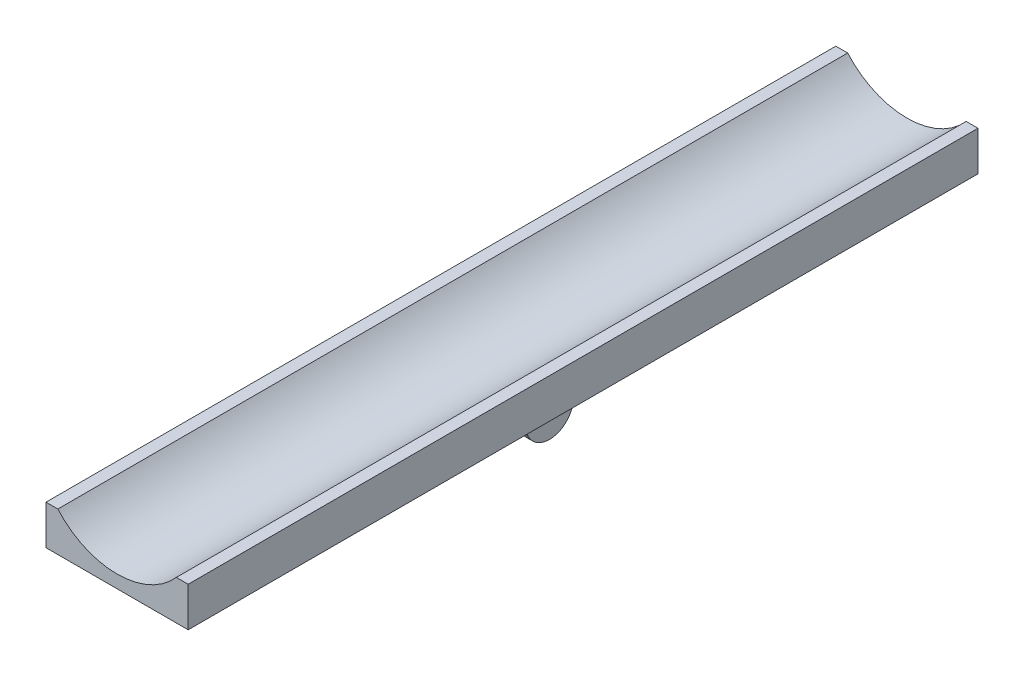
ISO-10303-21;
HEADER;
FILE_DESCRIPTION(('STEP AP214'),'2;1');
FILE_NAME('part.step','',(''),(''),'','','');
FILE_SCHEMA(('AUTOMOTIVE_DESIGN { 1 0 10303 214 1 1 1 1 }'));
ENDSEC;
DATA;
#1=APPLICATION_CONTEXT('core data for automotive mechanical design processes');
#2=APPLICATION_PROTOCOL_DEFINITION('international standard','automotive_design',2000,#1);
#3=PRODUCT_CONTEXT('',#1,'mechanical');
#4=PRODUCT('Part','Part','',(#3));
#5=PRODUCT_RELATED_PRODUCT_CATEGORY('part','',(#4));
#6=PRODUCT_DEFINITION_FORMATION('','',#4);
#7=PRODUCT_DEFINITION_CONTEXT('part definition',#1,'design');
#8=PRODUCT_DEFINITION('design','',#6,#7);
#9=PRODUCT_DEFINITION_SHAPE('','',#8);
#10=(LENGTH_UNIT() NAMED_UNIT(*) SI_UNIT(.MILLI.,.METRE.));
#11=(NAMED_UNIT(*) PLANE_ANGLE_UNIT() SI_UNIT($,.RADIAN.));
#12=(NAMED_UNIT(*) SI_UNIT($,.STERADIAN.) SOLID_ANGLE_UNIT());
#13=UNCERTAINTY_MEASURE_WITH_UNIT(LENGTH_MEASURE(1.E-05),#10,'distance_accuracy_value','');
#14=(GEOMETRIC_REPRESENTATION_CONTEXT(3) GLOBAL_UNCERTAINTY_ASSIGNED_CONTEXT((#13)) GLOBAL_UNIT_ASSIGNED_CONTEXT((#10,
#11,#12)) REPRESENTATION_CONTEXT('',''));
#15=CARTESIAN_POINT('',(0.,0.,0.));
#16=DIRECTION('',(0.,0.,1.));
#17=DIRECTION('',(1.,0.,0.));
#18=AXIS2_PLACEMENT_3D('',#15,#16,#17);
#19=CARTESIAN_POINT('',(15.,16.5,0.));
#20=DIRECTION('',(0.,1.,0.));
#21=DIRECTION('',(0.,0.,-1.));
#22=AXIS2_PLACEMENT_3D('',#19,#20,#21);
#23=PLANE('',#22);
#24=DIRECTION('',(0.,0.,-1.));
#25=VECTOR('',#24,1.);
#26=CARTESIAN_POINT('',(15.,16.5,0.));
#27=LINE('',#26,#25);
#28=CARTESIAN_POINT('',(15.,16.5,100.));
#29=VERTEX_POINT('',#28);
#30=CARTESIAN_POINT('',(15.,16.5,-100.));
#31=VERTEX_POINT('',#30);
#32=EDGE_CURVE('E11',#29,#31,#27,.T.);
#33=ORIENTED_EDGE('',*,*,#32,.F.);
#34=DIRECTION('',(-1.,0.,0.));
#35=VECTOR('',#34,1.);
#36=CARTESIAN_POINT('',(18.,16.5,100.));
#37=LINE('',#36,#35);
#38=CARTESIAN_POINT('',(18.,16.5,100.));
#39=VERTEX_POINT('',#38);
#40=EDGE_CURVE('E231',#39,#29,#37,.T.);
#41=ORIENTED_EDGE('',*,*,#40,.F.);
#42=DIRECTION('',(0.,0.,1.));
#43=VECTOR('',#42,1.);
#44=CARTESIAN_POINT('',(18.,16.5,0.));
#45=LINE('',#44,#43);
#46=CARTESIAN_POINT('',(18.,16.5,-100.));
#47=VERTEX_POINT('',#46);
#48=EDGE_CURVE('E46',#39,#47,#45,.F.);
#49=ORIENTED_EDGE('',*,*,#48,.T.);
#50=DIRECTION('',(1.,0.,0.));
#51=VECTOR('',#50,1.);
#52=CARTESIAN_POINT('',(15.,16.5,-100.));
#53=LINE('',#52,#51);
#54=EDGE_CURVE('E255',#31,#47,#53,.T.);
#55=ORIENTED_EDGE('',*,*,#54,.F.);
#56=EDGE_LOOP('',(#33,#41,#49,#55));
#57=FACE_BOUND('',#56,.T.);
#58=ADVANCED_FACE('F43',(#57),#23,.T.);
#59=CARTESIAN_POINT('',(18.,-1.5,0.));
#60=DIRECTION('',(-1.,0.,0.));
#61=DIRECTION('',(0.,0.,1.));
#62=AXIS2_PLACEMENT_3D('',#59,#60,#61);
#63=PLANE('',#62);
#64=ORIENTED_EDGE('',*,*,#48,.F.);
#65=DIRECTION('',(0.,1.,0.));
#66=VECTOR('',#65,1.);
#67=CARTESIAN_POINT('',(18.,6.5,100.));
#68=LINE('',#67,#66);
#69=CARTESIAN_POINT('',(18.,6.5,100.));
#70=VERTEX_POINT('',#69);
#71=EDGE_CURVE('E228',#70,#39,#68,.T.);
#72=ORIENTED_EDGE('',*,*,#71,.F.);
#73=DIRECTION('',(0.,0.,-1.));
#74=VECTOR('',#73,1.);
#75=CARTESIAN_POINT('',(18.,6.5,92.5));
#76=LINE('',#75,#74);
#77=CARTESIAN_POINT('',(18.,6.5,-100.));
#78=VERTEX_POINT('',#77);
#79=EDGE_CURVE('E259',#70,#78,#76,.T.);
#80=ORIENTED_EDGE('',*,*,#79,.T.);
#81=DIRECTION('',(0.,-1.,0.));
#82=VECTOR('',#81,1.);
#83=CARTESIAN_POINT('',(18.,16.5,-100.));
#84=LINE('',#83,#82);
#85=EDGE_CURVE('E240',#47,#78,#84,.T.);
#86=ORIENTED_EDGE('',*,*,#85,.F.);
#87=EDGE_LOOP('',(#64,#72,#80,#86));
#88=FACE_BOUND('',#87,.T.);
#89=ADVANCED_FACE('F284',(#88),#63,.F.);
#90=CARTESIAN_POINT('',(-15.,16.5,0.));
#91=DIRECTION('',(0.,1.,0.));
#92=DIRECTION('',(0.,0.,-1.));
#93=AXIS2_PLACEMENT_3D('',#90,#91,#92);
#94=PLANE('',#93);
#95=DIRECTION('',(0.,0.,1.));
#96=VECTOR('',#95,1.);
#97=CARTESIAN_POINT('',(-18.,16.5,0.));
#98=LINE('',#97,#96);
#99=CARTESIAN_POINT('',(-18.,16.5,100.));
#100=VERTEX_POINT('',#99);
#101=CARTESIAN_POINT('',(-18.,16.5,-100.));
#102=VERTEX_POINT('',#101);
#103=EDGE_CURVE('E263',#100,#102,#98,.F.);
#104=ORIENTED_EDGE('',*,*,#103,.F.);
#105=DIRECTION('',(-1.,0.,0.));
#106=VECTOR('',#105,1.);
#107=CARTESIAN_POINT('',(-15.,16.5,100.));
#108=LINE('',#107,#106);
#109=CARTESIAN_POINT('',(-15.,16.5,100.));
#110=VERTEX_POINT('',#109);
#111=EDGE_CURVE('E237',#110,#100,#108,.T.);
#112=ORIENTED_EDGE('',*,*,#111,.F.);
#113=DIRECTION('',(0.,0.,-1.));
#114=VECTOR('',#113,1.);
#115=CARTESIAN_POINT('',(-15.,16.5,0.));
#116=LINE('',#115,#114);
#117=CARTESIAN_POINT('',(-15.,16.5,-100.));
#118=VERTEX_POINT('',#117);
#119=EDGE_CURVE('E261',#110,#118,#116,.T.);
#120=ORIENTED_EDGE('',*,*,#119,.T.);
#121=DIRECTION('',(1.,0.,0.));
#122=VECTOR('',#121,1.);
#123=CARTESIAN_POINT('',(-18.,16.5,-100.));
#124=LINE('',#123,#122);
#125=EDGE_CURVE('E249',#102,#118,#124,.T.);
#126=ORIENTED_EDGE('',*,*,#125,.F.);
#127=EDGE_LOOP('',(#104,#112,#120,#126));
#128=FACE_BOUND('',#127,.T.);
#129=ADVANCED_FACE('F268',(#128),#94,.T.);
#130=CARTESIAN_POINT('',(-18.,-1.5,0.));
#131=DIRECTION('',(-1.,0.,0.));
#132=DIRECTION('',(0.,0.,1.));
#133=AXIS2_PLACEMENT_3D('',#130,#131,#132);
#134=PLANE('',#133);
#135=DIRECTION('',(0.,0.,-1.));
#136=VECTOR('',#135,1.);
#137=CARTESIAN_POINT('',(-18.,6.5,92.5));
#138=LINE('',#137,#136);
#139=CARTESIAN_POINT('',(-18.,6.5,100.));
#140=VERTEX_POINT('',#139);
#141=CARTESIAN_POINT('',(-18.,6.5,-100.));
#142=VERTEX_POINT('',#141);
#143=EDGE_CURVE('E258',#140,#142,#138,.T.);
#144=ORIENTED_EDGE('',*,*,#143,.F.);
#145=DIRECTION('',(0.,-1.,0.));
#146=VECTOR('',#145,1.);
#147=CARTESIAN_POINT('',(-18.,16.5,100.));
#148=LINE('',#147,#146);
#149=EDGE_CURVE('E211',#100,#140,#148,.T.);
#150=ORIENTED_EDGE('',*,*,#149,.F.);
#151=ORIENTED_EDGE('',*,*,#103,.T.);
#152=DIRECTION('',(0.,1.,0.));
#153=VECTOR('',#152,1.);
#154=CARTESIAN_POINT('',(-18.,6.5,-100.));
#155=LINE('',#154,#153);
#156=EDGE_CURVE('E246',#142,#102,#155,.T.);
#157=ORIENTED_EDGE('',*,*,#156,.F.);
#158=EDGE_LOOP('',(#144,#150,#151,#157));
#159=FACE_BOUND('',#158,.T.);
#160=ADVANCED_FACE('F289',(#159),#134,.T.);
#161=CARTESIAN_POINT('',(0.,29.7287565553229,-92.5));
#162=DIRECTION('',(0.,0.,1.));
#163=DIRECTION('',(1.,0.,0.));
#164=AXIS2_PLACEMENT_3D('',#161,#162,#163);
#165=CYLINDRICAL_SURFACE('',#164,19.9999999999999);
#166=ORIENTED_EDGE('',*,*,#119,.F.);
#167=CARTESIAN_POINT('',(0.,29.7287565553229,100.));
#168=DIRECTION('',(0.,0.,-1.));
#169=DIRECTION('',(1.,0.,0.));
#170=AXIS2_PLACEMENT_3D('',#167,#168,#169);
#171=CIRCLE('',#170,19.9999999999999);
#172=EDGE_CURVE('E234',#29,#110,#171,.T.);
#173=ORIENTED_EDGE('',*,*,#172,.F.);
#174=ORIENTED_EDGE('',*,*,#32,.T.);
#175=CARTESIAN_POINT('',(0.,29.7287565553229,-100.));
#176=DIRECTION('',(0.,0.,1.));
#177=DIRECTION('',(-1.,0.,0.));
#178=AXIS2_PLACEMENT_3D('',#175,#176,#177);
#179=CIRCLE('',#178,19.9999999999999);
#180=EDGE_CURVE('E252',#118,#31,#179,.T.);
#181=ORIENTED_EDGE('',*,*,#180,.F.);
#182=EDGE_LOOP('',(#166,#173,#174,#181));
#183=FACE_BOUND('',#182,.T.);
#184=ADVANCED_FACE('F276',(#183),#165,.F.);
#185=CARTESIAN_POINT('',(18.,6.5,92.5));
#186=DIRECTION('',(0.,1.,0.));
#187=DIRECTION('',(0.,0.,1.));
#188=AXIS2_PLACEMENT_3D('',#185,#186,#187);
#189=PLANE('',#188);
#190=DIRECTION('',(-1.,0.,0.));
#191=VECTOR('',#190,1.);
#192=CARTESIAN_POINT('',(20.3277234511636,6.5,-86.4999999999999));
#193=LINE('',#192,#191);
#194=CARTESIAN_POINT('',(3.,6.5,-86.4999999999999));
#195=VERTEX_POINT('',#194);
#196=CARTESIAN_POINT('',(-3.,6.5,-86.4999999999999));
#197=VERTEX_POINT('',#196);
#198=EDGE_CURVE('E175',#195,#197,#193,.T.);
#199=ORIENTED_EDGE('',*,*,#198,.F.);
#200=DIRECTION('',(0.,0.,1.));
#201=VECTOR('',#200,1.);
#202=CARTESIAN_POINT('',(3.,6.49999999999999,0.));
#203=LINE('',#202,#201);
#204=CARTESIAN_POINT('',(3.,6.5,-98.5000000000001));
#205=VERTEX_POINT('',#204);
#206=EDGE_CURVE('E176',#205,#195,#203,.T.);
#207=ORIENTED_EDGE('',*,*,#206,.F.);
#208=DIRECTION('',(-1.,0.,0.));
#209=VECTOR('',#208,1.);
#210=CARTESIAN_POINT('',(20.3277234511636,6.5,-98.5000000000001));
#211=LINE('',#210,#209);
#212=CARTESIAN_POINT('',(-3.,6.5,-98.5000000000001));
#213=VERTEX_POINT('',#212);
#214=EDGE_CURVE('E155',#205,#213,#211,.T.);
#215=ORIENTED_EDGE('',*,*,#214,.T.);
#216=DIRECTION('',(0.,0.,1.));
#217=VECTOR('',#216,1.);
#218=CARTESIAN_POINT('',(-3.,6.49999999999999,0.));
#219=LINE('',#218,#217);
#220=EDGE_CURVE('E162',#213,#197,#219,.T.);
#221=ORIENTED_EDGE('',*,*,#220,.T.);
#222=EDGE_LOOP('',(#199,#207,#215,#221));
#223=FACE_BOUND('',#222,.T.);
#224=DIRECTION('',(1.,0.,0.));
#225=VECTOR('',#224,1.);
#226=CARTESIAN_POINT('',(-33.0849528301415,6.5,-10.));
#227=LINE('',#226,#225);
#228=CARTESIAN_POINT('',(-9.50000000000002,6.5,-10.));
#229=VERTEX_POINT('',#228);
#230=CARTESIAN_POINT('',(9.49999999999998,6.5,-9.99999999999999));
#231=VERTEX_POINT('',#230);
#232=EDGE_CURVE('E218',#229,#231,#227,.T.);
#233=ORIENTED_EDGE('',*,*,#232,.F.);
#234=DIRECTION('',(0.,0.,-1.));
#235=VECTOR('',#234,1.);
#236=CARTESIAN_POINT('',(-9.50000000000002,6.5,0.));
#237=LINE('',#236,#235);
#238=CARTESIAN_POINT('',(-9.50000000000002,6.5,10.));
#239=VERTEX_POINT('',#238);
#240=EDGE_CURVE('E200',#239,#229,#237,.T.);
#241=ORIENTED_EDGE('',*,*,#240,.F.);
#242=DIRECTION('',(1.,0.,0.));
#243=VECTOR('',#242,1.);
#244=CARTESIAN_POINT('',(-33.0849528301415,6.5,10.));
#245=LINE('',#244,#243);
#246=CARTESIAN_POINT('',(9.49999999999998,6.5,10.));
#247=VERTEX_POINT('',#246);
#248=EDGE_CURVE('E215',#239,#247,#245,.T.);
#249=ORIENTED_EDGE('',*,*,#248,.T.);
#250=DIRECTION('',(0.,0.,-1.));
#251=VECTOR('',#250,1.);
#252=CARTESIAN_POINT('',(9.49999999999998,6.5,0.));
#253=LINE('',#252,#251);
#254=EDGE_CURVE('E179',#247,#231,#253,.T.);
#255=ORIENTED_EDGE('',*,*,#254,.T.);
#256=EDGE_LOOP('',(#233,#241,#249,#255));
#257=FACE_BOUND('',#256,.T.);
#258=ORIENTED_EDGE('',*,*,#143,.T.);
#259=DIRECTION('',(-1.,0.,0.));
#260=VECTOR('',#259,1.);
#261=CARTESIAN_POINT('',(18.,6.5,-100.));
#262=LINE('',#261,#260);
#263=EDGE_CURVE('E243',#78,#142,#262,.T.);
#264=ORIENTED_EDGE('',*,*,#263,.F.);
#265=ORIENTED_EDGE('',*,*,#79,.F.);
#266=DIRECTION('',(1.,0.,0.));
#267=VECTOR('',#266,1.);
#268=CARTESIAN_POINT('',(-18.,6.5,100.));
#269=LINE('',#268,#267);
#270=EDGE_CURVE('E225',#140,#70,#269,.T.);
#271=ORIENTED_EDGE('',*,*,#270,.F.);
#272=EDGE_LOOP('',(#258,#264,#265,#271));
#273=FACE_BOUND('',#272,.T.);
#274=ADVANCED_FACE('F291',(#223,#257,#273),#189,.F.);
#275=CARTESIAN_POINT('',(0.,29.7287565553229,-100.));
#276=DIRECTION('',(0.,0.,-1.));
#277=DIRECTION('',(-1.,0.,0.));
#278=AXIS2_PLACEMENT_3D('',#275,#276,#277);
#279=PLANE('',#278);
#280=ORIENTED_EDGE('',*,*,#85,.T.);
#281=ORIENTED_EDGE('',*,*,#263,.T.);
#282=ORIENTED_EDGE('',*,*,#156,.T.);
#283=ORIENTED_EDGE('',*,*,#125,.T.);
#284=ORIENTED_EDGE('',*,*,#180,.T.);
#285=ORIENTED_EDGE('',*,*,#54,.T.);
#286=EDGE_LOOP('',(#280,#281,#282,#283,#284,#285));
#287=FACE_BOUND('',#286,.T.);
#288=ADVANCED_FACE('F273',(#287),#279,.T.);
#289=CARTESIAN_POINT('',(0.,29.7287565553229,100.));
#290=DIRECTION('',(0.,0.,1.));
#291=DIRECTION('',(1.,0.,0.));
#292=AXIS2_PLACEMENT_3D('',#289,#290,#291);
#293=PLANE('',#292);
#294=ORIENTED_EDGE('',*,*,#149,.T.);
#295=ORIENTED_EDGE('',*,*,#270,.T.);
#296=ORIENTED_EDGE('',*,*,#71,.T.);
#297=ORIENTED_EDGE('',*,*,#40,.T.);
#298=ORIENTED_EDGE('',*,*,#172,.T.);
#299=ORIENTED_EDGE('',*,*,#111,.T.);
#300=EDGE_LOOP('',(#294,#295,#296,#297,#298,#299));
#301=FACE_BOUND('',#300,.T.);
#302=ADVANCED_FACE('F280',(#301),#293,.T.);
#303=CARTESIAN_POINT('',(-33.0849528301415,0.,0.));
#304=DIRECTION('',(1.,0.,0.));
#305=DIRECTION('',(0.,0.,-1.));
#306=AXIS2_PLACEMENT_3D('',#303,#304,#305);
#307=CYLINDRICAL_SURFACE('',#306,2.);
#308=CARTESIAN_POINT('',(-9.50000000000002,0.,0.));
#309=DIRECTION('',(-1.,0.,0.));
#310=DIRECTION('',(0.,0.,1.));
#311=AXIS2_PLACEMENT_3D('',#308,#309,#310);
#312=CIRCLE('',#311,2.);
#313=CARTESIAN_POINT('',(-9.50000000000002,0.,2.));
#314=VERTEX_POINT('',#313);
#315=EDGE_CURVE('E208',#314,#314,#312,.F.);
#316=ORIENTED_EDGE('',*,*,#315,.F.);
#317=EDGE_LOOP('',(#316));
#318=FACE_BOUND('',#317,.T.);
#319=CARTESIAN_POINT('',(9.49999999999998,0.,0.));
#320=DIRECTION('',(1.,0.,0.));
#321=DIRECTION('',(0.,0.,-1.));
#322=AXIS2_PLACEMENT_3D('',#319,#320,#321);
#323=CIRCLE('',#322,2.);
#324=CARTESIAN_POINT('',(9.49999999999998,0.,-2.));
#325=VERTEX_POINT('',#324);
#326=EDGE_CURVE('E194',#325,#325,#323,.T.);
#327=ORIENTED_EDGE('',*,*,#326,.T.);
#328=EDGE_LOOP('',(#327));
#329=FACE_BOUND('',#328,.T.);
#330=ADVANCED_FACE('F331',(#318,#329),#307,.F.);
#331=CARTESIAN_POINT('',(-33.0849528301415,-2.70274758413108,-5.3567859296856));
#332=DIRECTION('',(0.,-0.450457930688488,-0.892797654947551));
#333=DIRECTION('',(0.,0.892797654947551,-0.450457930688488));
#334=AXIS2_PLACEMENT_3D('',#331,#332,#333);
#335=PLANE('',#334);
#336=DIRECTION('',(1.,0.,0.));
#337=VECTOR('',#336,1.);
#338=CARTESIAN_POINT('',(-33.0849528301415,-2.70274758413071,-5.3567859296856));
#339=LINE('',#338,#337);
#340=CARTESIAN_POINT('',(-9.50000000000002,-2.70274758413079,-5.35678592968575));
#341=VERTEX_POINT('',#340);
#342=CARTESIAN_POINT('',(9.49999999999998,-2.70274758413079,-5.35678592968575));
#343=VERTEX_POINT('',#342);
#344=EDGE_CURVE('E207',#341,#343,#339,.T.);
#345=ORIENTED_EDGE('',*,*,#344,.F.);
#346=DIRECTION('',(0.,0.892797654947551,-0.450457930688488));
#347=VECTOR('',#346,1.);
#348=CARTESIAN_POINT('',(-9.50000000000002,-2.70274758413108,-5.3567859296856));
#349=LINE('',#348,#347);
#350=EDGE_CURVE('E212',#341,#229,#349,.T.);
#351=ORIENTED_EDGE('',*,*,#350,.T.);
#352=ORIENTED_EDGE('',*,*,#232,.T.);
#353=DIRECTION('',(0.,0.892797654947551,-0.450457930688488));
#354=VECTOR('',#353,1.);
#355=CARTESIAN_POINT('',(9.49999999999998,-2.70274758413108,-5.3567859296856));
#356=LINE('',#355,#354);
#357=EDGE_CURVE('E65',#343,#231,#356,.T.);
#358=ORIENTED_EDGE('',*,*,#357,.F.);
#359=EDGE_LOOP('',(#345,#351,#352,#358));
#360=FACE_BOUND('',#359,.T.);
#361=ADVANCED_FACE('F339',(#360),#335,.T.);
#362=CARTESIAN_POINT('',(-33.0849528301415,-2.7027475841311,5.35678592968521));
#363=DIRECTION('',(0.,0.450457930688517,-0.892797654947536));
#364=DIRECTION('',(0.,0.892797654947536,0.450457930688517));
#365=AXIS2_PLACEMENT_3D('',#362,#363,#364);
#366=PLANE('',#365);
#367=DIRECTION('',(0.,0.892797654947536,0.450457930688517));
#368=VECTOR('',#367,1.);
#369=CARTESIAN_POINT('',(-9.50000000000002,-2.7027475841311,5.35678592968521));
#370=LINE('',#369,#368);
#371=CARTESIAN_POINT('',(-9.50000000000002,-2.70274758413096,5.35678592968528));
#372=VERTEX_POINT('',#371);
#373=EDGE_CURVE('E202',#372,#239,#370,.T.);
#374=ORIENTED_EDGE('',*,*,#373,.F.);
#375=DIRECTION('',(1.,0.,0.));
#376=VECTOR('',#375,1.);
#377=CARTESIAN_POINT('',(-33.0849528301415,-2.70274758413096,5.35678592968528));
#378=LINE('',#377,#376);
#379=CARTESIAN_POINT('',(9.49999999999998,-2.70274758413096,5.35678592968528));
#380=VERTEX_POINT('',#379);
#381=EDGE_CURVE('E213',#372,#380,#378,.T.);
#382=ORIENTED_EDGE('',*,*,#381,.T.);
#383=DIRECTION('',(0.,0.892797654947536,0.450457930688517));
#384=VECTOR('',#383,1.);
#385=CARTESIAN_POINT('',(9.49999999999998,-2.7027475841311,5.35678592968521));
#386=LINE('',#385,#384);
#387=EDGE_CURVE('E197',#380,#247,#386,.T.);
#388=ORIENTED_EDGE('',*,*,#387,.T.);
#389=ORIENTED_EDGE('',*,*,#248,.F.);
#390=EDGE_LOOP('',(#374,#382,#388,#389));
#391=FACE_BOUND('',#390,.T.);
#392=ADVANCED_FACE('F348',(#391),#366,.F.);
#393=CARTESIAN_POINT('',(-33.0849528301415,0.,0.));
#394=DIRECTION('',(1.,0.,0.));
#395=DIRECTION('',(0.,0.,-1.));
#396=AXIS2_PLACEMENT_3D('',#393,#394,#395);
#397=CYLINDRICAL_SURFACE('',#396,6.);
#398=ORIENTED_EDGE('',*,*,#381,.F.);
#399=CARTESIAN_POINT('',(-9.50000000000002,0.,0.));
#400=DIRECTION('',(-1.,0.,0.));
#401=DIRECTION('',(0.,0.,1.));
#402=AXIS2_PLACEMENT_3D('',#399,#400,#401);
#403=CIRCLE('',#402,6.);
#404=EDGE_CURVE('E204',#372,#341,#403,.F.);
#405=ORIENTED_EDGE('',*,*,#404,.T.);
#406=ORIENTED_EDGE('',*,*,#344,.T.);
#407=CARTESIAN_POINT('',(9.49999999999998,0.,0.));
#408=DIRECTION('',(1.,0.,0.));
#409=DIRECTION('',(0.,0.,-1.));
#410=AXIS2_PLACEMENT_3D('',#407,#408,#409);
#411=CIRCLE('',#410,6.);
#412=EDGE_CURVE('E192',#380,#343,#411,.T.);
#413=ORIENTED_EDGE('',*,*,#412,.F.);
#414=EDGE_LOOP('',(#398,#405,#406,#413));
#415=FACE_BOUND('',#414,.T.);
#416=ADVANCED_FACE('F357',(#415),#397,.T.);
#417=CARTESIAN_POINT('',(-9.50000000000002,-140.,0.));
#418=DIRECTION('',(-1.,0.,0.));
#419=DIRECTION('',(0.,0.,-1.));
#420=AXIS2_PLACEMENT_3D('',#417,#418,#419);
#421=PLANE('',#420);
#422=ORIENTED_EDGE('',*,*,#404,.F.);
#423=ORIENTED_EDGE('',*,*,#373,.T.);
#424=ORIENTED_EDGE('',*,*,#240,.T.);
#425=ORIENTED_EDGE('',*,*,#350,.F.);
#426=EDGE_LOOP('',(#422,#423,#424,#425));
#427=FACE_BOUND('',#426,.T.);
#428=ORIENTED_EDGE('',*,*,#315,.T.);
#429=EDGE_LOOP('',(#428));
#430=FACE_BOUND('',#429,.T.);
#431=ADVANCED_FACE('F366',(#427,#430),#421,.T.);
#432=CARTESIAN_POINT('',(9.49999999999998,-140.,0.));
#433=DIRECTION('',(1.,0.,0.));
#434=DIRECTION('',(0.,0.,-1.));
#435=AXIS2_PLACEMENT_3D('',#432,#433,#434);
#436=PLANE('',#435);
#437=ORIENTED_EDGE('',*,*,#326,.F.);
#438=EDGE_LOOP('',(#437));
#439=FACE_BOUND('',#438,.T.);
#440=ORIENTED_EDGE('',*,*,#387,.F.);
#441=ORIENTED_EDGE('',*,*,#412,.T.);
#442=ORIENTED_EDGE('',*,*,#357,.T.);
#443=ORIENTED_EDGE('',*,*,#254,.F.);
#444=EDGE_LOOP('',(#440,#441,#442,#443));
#445=FACE_BOUND('',#444,.T.);
#446=ADVANCED_FACE('F374',(#439,#445),#436,.T.);
#447=CARTESIAN_POINT('',(20.3277234511636,0.,-92.5));
#448=DIRECTION('',(-1.,0.,0.));
#449=DIRECTION('',(0.,0.,1.));
#450=AXIS2_PLACEMENT_3D('',#447,#448,#449);
#451=CYLINDRICAL_SURFACE('',#450,6.00000000000009);
#452=CARTESIAN_POINT('',(3.,0.,-92.5));
#453=DIRECTION('',(1.,0.,0.));
#454=DIRECTION('',(0.,1.,0.));
#455=AXIS2_PLACEMENT_3D('',#452,#453,#454);
#456=CIRCLE('',#455,6.00000000000009);
#457=CARTESIAN_POINT('',(3.,0.,-86.4999999999999));
#458=VERTEX_POINT('',#457);
#459=CARTESIAN_POINT('',(3.,0.,-98.5000000000001));
#460=VERTEX_POINT('',#459);
#461=EDGE_CURVE('E181',#458,#460,#456,.T.);
#462=ORIENTED_EDGE('',*,*,#461,.F.);
#463=DIRECTION('',(-1.,0.,0.));
#464=VECTOR('',#463,1.);
#465=CARTESIAN_POINT('',(20.3277234511636,0.,-86.4999999999999));
#466=LINE('',#465,#464);
#467=CARTESIAN_POINT('',(-3.,0.,-86.4999999999999));
#468=VERTEX_POINT('',#467);
#469=EDGE_CURVE('E156',#458,#468,#466,.T.);
#470=ORIENTED_EDGE('',*,*,#469,.T.);
#471=CARTESIAN_POINT('',(-3.,0.,-92.5));
#472=DIRECTION('',(-1.,0.,0.));
#473=DIRECTION('',(0.,-1.,0.));
#474=AXIS2_PLACEMENT_3D('',#471,#472,#473);
#475=CIRCLE('',#474,6.00000000000009);
#476=CARTESIAN_POINT('',(-3.,0.,-98.5000000000001));
#477=VERTEX_POINT('',#476);
#478=EDGE_CURVE('E160',#468,#477,#475,.F.);
#479=ORIENTED_EDGE('',*,*,#478,.T.);
#480=DIRECTION('',(-1.,0.,0.));
#481=VECTOR('',#480,1.);
#482=CARTESIAN_POINT('',(20.3277234511636,0.,-98.5000000000001));
#483=LINE('',#482,#481);
#484=EDGE_CURVE('E144',#460,#477,#483,.T.);
#485=ORIENTED_EDGE('',*,*,#484,.F.);
#486=EDGE_LOOP('',(#462,#470,#479,#485));
#487=FACE_BOUND('',#486,.T.);
#488=ADVANCED_FACE('F165',(#487),#451,.T.);
#489=CARTESIAN_POINT('',(20.3277234511636,0.,-98.5000000000001));
#490=DIRECTION('',(0.,0.,1.));
#491=DIRECTION('',(1.,0.,0.));
#492=AXIS2_PLACEMENT_3D('',#489,#490,#491);
#493=PLANE('',#492);
#494=DIRECTION('',(0.,1.,0.));
#495=VECTOR('',#494,1.);
#496=CARTESIAN_POINT('',(3.,0.,-98.5000000000001));
#497=LINE('',#496,#495);
#498=EDGE_CURVE('E150',#460,#205,#497,.T.);
#499=ORIENTED_EDGE('',*,*,#498,.F.);
#500=ORIENTED_EDGE('',*,*,#484,.T.);
#501=DIRECTION('',(0.,1.,0.));
#502=VECTOR('',#501,1.);
#503=CARTESIAN_POINT('',(-3.,0.,-98.5000000000001));
#504=LINE('',#503,#502);
#505=EDGE_CURVE('E147',#477,#213,#504,.T.);
#506=ORIENTED_EDGE('',*,*,#505,.T.);
#507=ORIENTED_EDGE('',*,*,#214,.F.);
#508=EDGE_LOOP('',(#499,#500,#506,#507));
#509=FACE_BOUND('',#508,.T.);
#510=ADVANCED_FACE('F146',(#509),#493,.F.);
#511=CARTESIAN_POINT('',(20.3277234511636,0.,-92.5));
#512=DIRECTION('',(-1.,0.,0.));
#513=DIRECTION('',(0.,0.,1.));
#514=AXIS2_PLACEMENT_3D('',#511,#512,#513);
#515=CYLINDRICAL_SURFACE('',#514,2.);
#516=CARTESIAN_POINT('',(3.,0.,-92.5));
#517=DIRECTION('',(1.,0.,0.));
#518=DIRECTION('',(0.,1.,0.));
#519=AXIS2_PLACEMENT_3D('',#516,#517,#518);
#520=CIRCLE('',#519,2.);
#521=CARTESIAN_POINT('',(3.,2.00000000000003,-92.5));
#522=VERTEX_POINT('',#521);
#523=EDGE_CURVE('E172',#522,#522,#520,.T.);
#524=ORIENTED_EDGE('',*,*,#523,.T.);
#525=EDGE_LOOP('',(#524));
#526=FACE_BOUND('',#525,.T.);
#527=CARTESIAN_POINT('',(-3.,0.,-92.5));
#528=DIRECTION('',(-1.,0.,0.));
#529=DIRECTION('',(0.,-1.,0.));
#530=AXIS2_PLACEMENT_3D('',#527,#528,#529);
#531=CIRCLE('',#530,2.);
#532=CARTESIAN_POINT('',(-3.,-1.99999999999996,-92.5));
#533=VERTEX_POINT('',#532);
#534=EDGE_CURVE('E163',#533,#533,#531,.F.);
#535=ORIENTED_EDGE('',*,*,#534,.F.);
#536=EDGE_LOOP('',(#535));
#537=FACE_BOUND('',#536,.T.);
#538=ADVANCED_FACE('F401',(#526,#537),#515,.F.);
#539=CARTESIAN_POINT('',(20.3277234511636,-1.84681330057839E-13,-86.4999999999999));
#540=DIRECTION('',(0.,0.,-1.));
#541=DIRECTION('',(0.,1.,0.));
#542=AXIS2_PLACEMENT_3D('',#539,#540,#541);
#543=PLANE('',#542);
#544=DIRECTION('',(0.,-1.,0.));
#545=VECTOR('',#544,1.);
#546=CARTESIAN_POINT('',(3.,-1.84681324454868E-13,-86.4999999999999));
#547=LINE('',#546,#545);
#548=EDGE_CURVE('E183',#195,#458,#547,.T.);
#549=ORIENTED_EDGE('',*,*,#548,.F.);
#550=ORIENTED_EDGE('',*,*,#198,.T.);
#551=DIRECTION('',(0.,-1.,0.));
#552=VECTOR('',#551,1.);
#553=CARTESIAN_POINT('',(-3.,-1.84681335660811E-13,-86.4999999999999));
#554=LINE('',#553,#552);
#555=EDGE_CURVE('E57',#197,#468,#554,.T.);
#556=ORIENTED_EDGE('',*,*,#555,.T.);
#557=ORIENTED_EDGE('',*,*,#469,.F.);
#558=EDGE_LOOP('',(#549,#550,#556,#557));
#559=FACE_BOUND('',#558,.T.);
#560=ADVANCED_FACE('F410',(#559),#543,.F.);
#561=CARTESIAN_POINT('',(3.,-108.302789671016,-73.2514740960333));
#562=DIRECTION('',(1.,0.,0.));
#563=DIRECTION('',(0.,0.984570815191054,-0.17498659912697));
#564=AXIS2_PLACEMENT_3D('',#561,#562,#563);
#565=PLANE('',#564);
#566=ORIENTED_EDGE('',*,*,#523,.F.);
#567=EDGE_LOOP('',(#566));
#568=FACE_BOUND('',#567,.T.);
#569=ORIENTED_EDGE('',*,*,#548,.T.);
#570=ORIENTED_EDGE('',*,*,#461,.T.);
#571=ORIENTED_EDGE('',*,*,#498,.T.);
#572=ORIENTED_EDGE('',*,*,#206,.T.);
#573=EDGE_LOOP('',(#569,#570,#571,#572));
#574=FACE_BOUND('',#573,.T.);
#575=ADVANCED_FACE('F420',(#568,#574),#565,.T.);
#576=CARTESIAN_POINT('',(-3.,-108.302789671016,-73.2514740960333));
#577=DIRECTION('',(-1.,0.,0.));
#578=DIRECTION('',(0.,0.984570815191054,-0.17498659912697));
#579=AXIS2_PLACEMENT_3D('',#576,#577,#578);
#580=PLANE('',#579);
#581=ORIENTED_EDGE('',*,*,#478,.F.);
#582=ORIENTED_EDGE('',*,*,#555,.F.);
#583=ORIENTED_EDGE('',*,*,#220,.F.);
#584=ORIENTED_EDGE('',*,*,#505,.F.);
#585=EDGE_LOOP('',(#581,#582,#583,#584));
#586=FACE_BOUND('',#585,.T.);
#587=ORIENTED_EDGE('',*,*,#534,.T.);
#588=EDGE_LOOP('',(#587));
#589=FACE_BOUND('',#588,.T.);
#590=ADVANCED_FACE('F158',(#586,#589),#580,.T.);
#591=CLOSED_SHELL('',(#58,#89,#129,#160,#184,#274,#288,#302,#330,#361,#392,#416,#431,#446,#488,
#510,#538,#560,#575,#590));
#592=MANIFOLD_SOLID_BREP('B2',#591);
#593=ADVANCED_BREP_SHAPE_REPRESENTATION('',(#18,#592),#14);
#594=SHAPE_DEFINITION_REPRESENTATION(#9,#593);
ENDSEC;
END-ISO-10303-21;
